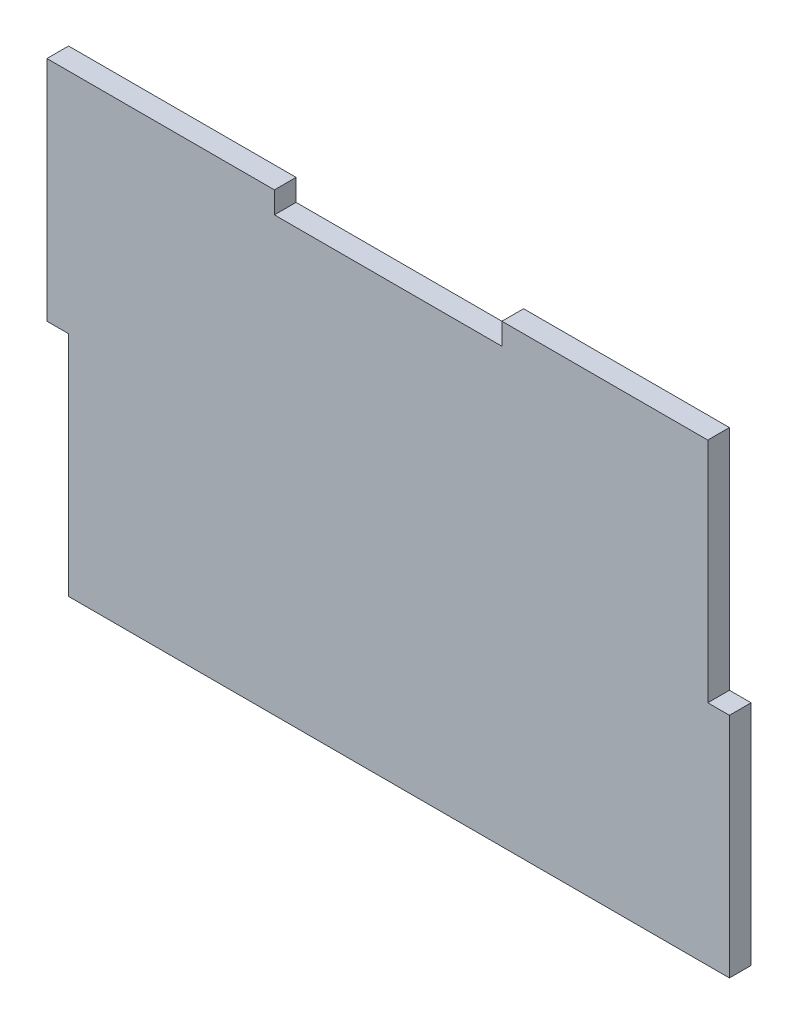
ISO-10303-21;
HEADER;
FILE_DESCRIPTION(('STEP AP214'),'2;1');
FILE_NAME('part.step','',(''),(''),'','','');
FILE_SCHEMA(('AUTOMOTIVE_DESIGN { 1 0 10303 214 1 1 1 1 }'));
ENDSEC;
DATA;
#1=APPLICATION_CONTEXT('core data for automotive mechanical design processes');
#2=APPLICATION_PROTOCOL_DEFINITION('international standard','automotive_design',2000,#1);
#3=PRODUCT_CONTEXT('',#1,'mechanical');
#4=PRODUCT('Part','Part','',(#3));
#5=PRODUCT_RELATED_PRODUCT_CATEGORY('part','',(#4));
#6=PRODUCT_DEFINITION_FORMATION('','',#4);
#7=PRODUCT_DEFINITION_CONTEXT('part definition',#1,'design');
#8=PRODUCT_DEFINITION('design','',#6,#7);
#9=PRODUCT_DEFINITION_SHAPE('','',#8);
#10=(LENGTH_UNIT() NAMED_UNIT(*) SI_UNIT(.MILLI.,.METRE.));
#11=(NAMED_UNIT(*) PLANE_ANGLE_UNIT() SI_UNIT($,.RADIAN.));
#12=(NAMED_UNIT(*) SI_UNIT($,.STERADIAN.) SOLID_ANGLE_UNIT());
#13=UNCERTAINTY_MEASURE_WITH_UNIT(LENGTH_MEASURE(1.E-05),#10,'distance_accuracy_value','');
#14=(GEOMETRIC_REPRESENTATION_CONTEXT(3) GLOBAL_UNCERTAINTY_ASSIGNED_CONTEXT((#13)) GLOBAL_UNIT_ASSIGNED_CONTEXT((#10,
#11,#12)) REPRESENTATION_CONTEXT('',''));
#15=CARTESIAN_POINT('',(0.,0.,0.));
#16=DIRECTION('',(0.,0.,1.));
#17=DIRECTION('',(1.,0.,0.));
#18=AXIS2_PLACEMENT_3D('',#15,#16,#17);
#19=CARTESIAN_POINT('',(-16.6666666666667,50.,3.175));
#20=DIRECTION('',(0.,-1.,0.));
#21=DIRECTION('',(1.,0.,0.));
#22=AXIS2_PLACEMENT_3D('',#19,#20,#21);
#23=PLANE('',#22);
#24=DIRECTION('',(-1.,0.,0.));
#25=VECTOR('',#24,1.);
#26=CARTESIAN_POINT('',(-16.6666666666667,50.,0.));
#27=LINE('',#26,#25);
#28=CARTESIAN_POINT('',(-16.6666666666667,50.,0.));
#29=VERTEX_POINT('',#28);
#30=CARTESIAN_POINT('',(-50.,50.,0.));
#31=VERTEX_POINT('',#30);
#32=EDGE_CURVE('E164',#29,#31,#27,.T.);
#33=ORIENTED_EDGE('',*,*,#32,.T.);
#34=DIRECTION('',(0.,0.,-1.));
#35=VECTOR('',#34,1.);
#36=CARTESIAN_POINT('',(-50.,50.,3.175));
#37=LINE('',#36,#35);
#38=CARTESIAN_POINT('',(-50.,50.,3.175));
#39=VERTEX_POINT('',#38);
#40=EDGE_CURVE('E11',#39,#31,#37,.T.);
#41=ORIENTED_EDGE('',*,*,#40,.F.);
#42=DIRECTION('',(-1.,0.,0.));
#43=VECTOR('',#42,1.);
#44=CARTESIAN_POINT('',(-16.6666666666667,50.,3.175));
#45=LINE('',#44,#43);
#46=CARTESIAN_POINT('',(-16.6666666666667,50.,3.175));
#47=VERTEX_POINT('',#46);
#48=EDGE_CURVE('E199',#47,#39,#45,.T.);
#49=ORIENTED_EDGE('',*,*,#48,.F.);
#50=DIRECTION('',(0.,0.,-1.));
#51=VECTOR('',#50,1.);
#52=CARTESIAN_POINT('',(-16.6666666666667,50.,3.175));
#53=LINE('',#52,#51);
#54=EDGE_CURVE('E160',#47,#29,#53,.T.);
#55=ORIENTED_EDGE('',*,*,#54,.T.);
#56=EDGE_LOOP('',(#33,#41,#49,#55));
#57=FACE_BOUND('',#56,.T.);
#58=ADVANCED_FACE('F39',(#57),#23,.F.);
#59=CARTESIAN_POINT('',(-50.,16.6666666666667,3.175));
#60=DIRECTION('',(1.,0.,0.));
#61=DIRECTION('',(0.,0.,-1.));
#62=AXIS2_PLACEMENT_3D('',#59,#60,#61);
#63=PLANE('',#62);
#64=DIRECTION('',(0.,-1.,0.));
#65=VECTOR('',#64,1.);
#66=CARTESIAN_POINT('',(-50.,16.6666666666667,0.));
#67=LINE('',#66,#65);
#68=CARTESIAN_POINT('',(-50.,16.6666666666667,0.));
#69=VERTEX_POINT('',#68);
#70=EDGE_CURVE('E168',#31,#69,#67,.T.);
#71=ORIENTED_EDGE('',*,*,#70,.T.);
#72=DIRECTION('',(0.,0.,-1.));
#73=VECTOR('',#72,1.);
#74=CARTESIAN_POINT('',(-50.,16.6666666666667,3.175));
#75=LINE('',#74,#73);
#76=CARTESIAN_POINT('',(-50.,16.6666666666667,3.175));
#77=VERTEX_POINT('',#76);
#78=EDGE_CURVE('E48',#77,#69,#75,.T.);
#79=ORIENTED_EDGE('',*,*,#78,.F.);
#80=DIRECTION('',(0.,-1.,0.));
#81=VECTOR('',#80,1.);
#82=CARTESIAN_POINT('',(-50.,16.6666666666667,3.175));
#83=LINE('',#82,#81);
#84=EDGE_CURVE('E111',#39,#77,#83,.T.);
#85=ORIENTED_EDGE('',*,*,#84,.F.);
#86=ORIENTED_EDGE('',*,*,#40,.T.);
#87=EDGE_LOOP('',(#71,#79,#85,#86));
#88=FACE_BOUND('',#87,.T.);
#89=ADVANCED_FACE('F292',(#88),#63,.F.);
#90=CARTESIAN_POINT('',(-50.,16.6666666666667,3.175));
#91=DIRECTION('',(0.,1.,0.));
#92=DIRECTION('',(0.,0.,1.));
#93=AXIS2_PLACEMENT_3D('',#90,#91,#92);
#94=PLANE('',#93);
#95=DIRECTION('',(1.,0.,0.));
#96=VECTOR('',#95,1.);
#97=CARTESIAN_POINT('',(-50.,16.6666666666667,0.));
#98=LINE('',#97,#96);
#99=CARTESIAN_POINT('',(-46.825,16.6666666666667,0.));
#100=VERTEX_POINT('',#99);
#101=EDGE_CURVE('E171',#69,#100,#98,.T.);
#102=ORIENTED_EDGE('',*,*,#101,.T.);
#103=DIRECTION('',(0.,0.,-1.));
#104=VECTOR('',#103,1.);
#105=CARTESIAN_POINT('',(-46.825,16.6666666666667,3.175));
#106=LINE('',#105,#104);
#107=CARTESIAN_POINT('',(-46.825,16.6666666666667,3.175));
#108=VERTEX_POINT('',#107);
#109=EDGE_CURVE('E226',#108,#100,#106,.T.);
#110=ORIENTED_EDGE('',*,*,#109,.F.);
#111=DIRECTION('',(1.,0.,0.));
#112=VECTOR('',#111,1.);
#113=CARTESIAN_POINT('',(-50.,16.6666666666667,3.175));
#114=LINE('',#113,#112);
#115=EDGE_CURVE('E236',#77,#108,#114,.T.);
#116=ORIENTED_EDGE('',*,*,#115,.F.);
#117=ORIENTED_EDGE('',*,*,#78,.T.);
#118=EDGE_LOOP('',(#102,#110,#116,#117));
#119=FACE_BOUND('',#118,.T.);
#120=ADVANCED_FACE('F234',(#119),#94,.F.);
#121=CARTESIAN_POINT('',(-46.825,16.6666666666667,3.175));
#122=DIRECTION('',(1.,0.,0.));
#123=DIRECTION('',(0.,0.,-1.));
#124=AXIS2_PLACEMENT_3D('',#121,#122,#123);
#125=PLANE('',#124);
#126=DIRECTION('',(0.,-1.,0.));
#127=VECTOR('',#126,1.);
#128=CARTESIAN_POINT('',(-46.825,16.6666666666667,0.));
#129=LINE('',#128,#127);
#130=CARTESIAN_POINT('',(-46.825,-16.6666666666667,0.));
#131=VERTEX_POINT('',#130);
#132=EDGE_CURVE('E174',#100,#131,#129,.T.);
#133=ORIENTED_EDGE('',*,*,#132,.T.);
#134=DIRECTION('',(0.,0.,-1.));
#135=VECTOR('',#134,1.);
#136=CARTESIAN_POINT('',(-46.825,-16.6666666666667,3.175));
#137=LINE('',#136,#135);
#138=CARTESIAN_POINT('',(-46.825,-16.6666666666667,3.175));
#139=VERTEX_POINT('',#138);
#140=EDGE_CURVE('E222',#139,#131,#137,.T.);
#141=ORIENTED_EDGE('',*,*,#140,.F.);
#142=DIRECTION('',(0.,-1.,0.));
#143=VECTOR('',#142,1.);
#144=CARTESIAN_POINT('',(-46.825,16.6666666666667,3.175));
#145=LINE('',#144,#143);
#146=EDGE_CURVE('E254',#108,#139,#145,.T.);
#147=ORIENTED_EDGE('',*,*,#146,.F.);
#148=ORIENTED_EDGE('',*,*,#109,.T.);
#149=EDGE_LOOP('',(#133,#141,#147,#148));
#150=FACE_BOUND('',#149,.T.);
#151=ADVANCED_FACE('F244',(#150),#125,.F.);
#152=CARTESIAN_POINT('',(50.,-16.6666666666667,3.175));
#153=DIRECTION('',(0.,1.,0.));
#154=DIRECTION('',(-1.,0.,0.));
#155=AXIS2_PLACEMENT_3D('',#152,#153,#154);
#156=PLANE('',#155);
#157=DIRECTION('',(1.,0.,0.));
#158=VECTOR('',#157,1.);
#159=CARTESIAN_POINT('',(50.,-16.6666666666667,0.));
#160=LINE('',#159,#158);
#161=CARTESIAN_POINT('',(50.,-16.6666666666667,0.));
#162=VERTEX_POINT('',#161);
#163=EDGE_CURVE('E178',#131,#162,#160,.T.);
#164=ORIENTED_EDGE('',*,*,#163,.T.);
#165=DIRECTION('',(0.,0.,-1.));
#166=VECTOR('',#165,1.);
#167=CARTESIAN_POINT('',(50.,-16.6666666666667,3.175));
#168=LINE('',#167,#166);
#169=CARTESIAN_POINT('',(50.,-16.6666666666667,3.175));
#170=VERTEX_POINT('',#169);
#171=EDGE_CURVE('E218',#170,#162,#168,.T.);
#172=ORIENTED_EDGE('',*,*,#171,.F.);
#173=DIRECTION('',(1.,0.,0.));
#174=VECTOR('',#173,1.);
#175=CARTESIAN_POINT('',(-46.825,-16.6666666666667,3.175));
#176=LINE('',#175,#174);
#177=EDGE_CURVE('E250',#139,#170,#176,.T.);
#178=ORIENTED_EDGE('',*,*,#177,.F.);
#179=ORIENTED_EDGE('',*,*,#140,.T.);
#180=EDGE_LOOP('',(#164,#172,#178,#179));
#181=FACE_BOUND('',#180,.T.);
#182=ADVANCED_FACE('F248',(#181),#156,.F.);
#183=CARTESIAN_POINT('',(50.,-16.6666666666667,3.175));
#184=DIRECTION('',(-1.,0.,0.));
#185=DIRECTION('',(0.,0.,1.));
#186=AXIS2_PLACEMENT_3D('',#183,#184,#185);
#187=PLANE('',#186);
#188=DIRECTION('',(0.,1.,0.));
#189=VECTOR('',#188,1.);
#190=CARTESIAN_POINT('',(50.,-16.6666666666667,0.));
#191=LINE('',#190,#189);
#192=CARTESIAN_POINT('',(50.,16.6666666666667,0.));
#193=VERTEX_POINT('',#192);
#194=EDGE_CURVE('E181',#162,#193,#191,.T.);
#195=ORIENTED_EDGE('',*,*,#194,.T.);
#196=DIRECTION('',(0.,0.,-1.));
#197=VECTOR('',#196,1.);
#198=CARTESIAN_POINT('',(50.,16.6666666666667,3.175));
#199=LINE('',#198,#197);
#200=CARTESIAN_POINT('',(50.,16.6666666666667,3.175));
#201=VERTEX_POINT('',#200);
#202=EDGE_CURVE('E214',#201,#193,#199,.T.);
#203=ORIENTED_EDGE('',*,*,#202,.F.);
#204=DIRECTION('',(0.,1.,0.));
#205=VECTOR('',#204,1.);
#206=CARTESIAN_POINT('',(50.,-16.6666666666667,3.175));
#207=LINE('',#206,#205);
#208=EDGE_CURVE('E253',#170,#201,#207,.T.);
#209=ORIENTED_EDGE('',*,*,#208,.F.);
#210=ORIENTED_EDGE('',*,*,#171,.T.);
#211=EDGE_LOOP('',(#195,#203,#209,#210));
#212=FACE_BOUND('',#211,.T.);
#213=ADVANCED_FACE('F305',(#212),#187,.F.);
#214=CARTESIAN_POINT('',(50.,16.6666666666667,3.175));
#215=DIRECTION('',(0.,-1.,0.));
#216=DIRECTION('',(0.,0.,-1.));
#217=AXIS2_PLACEMENT_3D('',#214,#215,#216);
#218=PLANE('',#217);
#219=DIRECTION('',(-1.,0.,0.));
#220=VECTOR('',#219,1.);
#221=CARTESIAN_POINT('',(50.,16.6666666666667,0.));
#222=LINE('',#221,#220);
#223=CARTESIAN_POINT('',(46.825,16.6666666666667,0.));
#224=VERTEX_POINT('',#223);
#225=EDGE_CURVE('E184',#193,#224,#222,.T.);
#226=ORIENTED_EDGE('',*,*,#225,.T.);
#227=DIRECTION('',(0.,0.,-1.));
#228=VECTOR('',#227,1.);
#229=CARTESIAN_POINT('',(46.825,16.6666666666667,3.175));
#230=LINE('',#229,#228);
#231=CARTESIAN_POINT('',(46.825,16.6666666666667,3.175));
#232=VERTEX_POINT('',#231);
#233=EDGE_CURVE('E210',#232,#224,#230,.T.);
#234=ORIENTED_EDGE('',*,*,#233,.F.);
#235=DIRECTION('',(-1.,0.,0.));
#236=VECTOR('',#235,1.);
#237=CARTESIAN_POINT('',(50.,16.6666666666667,3.175));
#238=LINE('',#237,#236);
#239=EDGE_CURVE('E258',#201,#232,#238,.T.);
#240=ORIENTED_EDGE('',*,*,#239,.F.);
#241=ORIENTED_EDGE('',*,*,#202,.T.);
#242=EDGE_LOOP('',(#226,#234,#240,#241));
#243=FACE_BOUND('',#242,.T.);
#244=ADVANCED_FACE('F308',(#243),#218,.F.);
#245=CARTESIAN_POINT('',(46.825,16.6666666666667,3.175));
#246=DIRECTION('',(-1.,0.,0.));
#247=DIRECTION('',(0.,0.,1.));
#248=AXIS2_PLACEMENT_3D('',#245,#246,#247);
#249=PLANE('',#248);
#250=DIRECTION('',(0.,1.,0.));
#251=VECTOR('',#250,1.);
#252=CARTESIAN_POINT('',(46.825,16.6666666666667,0.));
#253=LINE('',#252,#251);
#254=CARTESIAN_POINT('',(46.825,50.,0.));
#255=VERTEX_POINT('',#254);
#256=EDGE_CURVE('E187',#224,#255,#253,.T.);
#257=ORIENTED_EDGE('',*,*,#256,.T.);
#258=DIRECTION('',(0.,0.,-1.));
#259=VECTOR('',#258,1.);
#260=CARTESIAN_POINT('',(46.825,50.,3.175));
#261=LINE('',#260,#259);
#262=CARTESIAN_POINT('',(46.825,50.,3.175));
#263=VERTEX_POINT('',#262);
#264=EDGE_CURVE('E206',#263,#255,#261,.T.);
#265=ORIENTED_EDGE('',*,*,#264,.F.);
#266=DIRECTION('',(0.,1.,0.));
#267=VECTOR('',#266,1.);
#268=CARTESIAN_POINT('',(46.825,16.6666666666667,3.175));
#269=LINE('',#268,#267);
#270=EDGE_CURVE('E265',#232,#263,#269,.T.);
#271=ORIENTED_EDGE('',*,*,#270,.F.);
#272=ORIENTED_EDGE('',*,*,#233,.T.);
#273=EDGE_LOOP('',(#257,#265,#271,#272));
#274=FACE_BOUND('',#273,.T.);
#275=ADVANCED_FACE('F273',(#274),#249,.F.);
#276=CARTESIAN_POINT('',(46.825,50.,3.175));
#277=DIRECTION('',(0.,-1.,0.));
#278=DIRECTION('',(1.,0.,0.));
#279=AXIS2_PLACEMENT_3D('',#276,#277,#278);
#280=PLANE('',#279);
#281=DIRECTION('',(-1.,0.,0.));
#282=VECTOR('',#281,1.);
#283=CARTESIAN_POINT('',(46.825,50.,0.));
#284=LINE('',#283,#282);
#285=CARTESIAN_POINT('',(16.6666666666667,50.,0.));
#286=VERTEX_POINT('',#285);
#287=EDGE_CURVE('E190',#255,#286,#284,.T.);
#288=ORIENTED_EDGE('',*,*,#287,.T.);
#289=DIRECTION('',(0.,0.,-1.));
#290=VECTOR('',#289,1.);
#291=CARTESIAN_POINT('',(16.6666666666667,50.,3.175));
#292=LINE('',#291,#290);
#293=CARTESIAN_POINT('',(16.6666666666667,50.,3.175));
#294=VERTEX_POINT('',#293);
#295=EDGE_CURVE('E153',#294,#286,#292,.T.);
#296=ORIENTED_EDGE('',*,*,#295,.F.);
#297=DIRECTION('',(-1.,0.,0.));
#298=VECTOR('',#297,1.);
#299=CARTESIAN_POINT('',(46.825,50.,3.175));
#300=LINE('',#299,#298);
#301=EDGE_CURVE('E142',#263,#294,#300,.T.);
#302=ORIENTED_EDGE('',*,*,#301,.F.);
#303=ORIENTED_EDGE('',*,*,#264,.T.);
#304=EDGE_LOOP('',(#288,#296,#302,#303));
#305=FACE_BOUND('',#304,.T.);
#306=ADVANCED_FACE('F277',(#305),#280,.F.);
#307=CARTESIAN_POINT('',(16.6666666666667,50.,3.175));
#308=DIRECTION('',(1.,0.,0.));
#309=DIRECTION('',(0.,0.,-1.));
#310=AXIS2_PLACEMENT_3D('',#307,#308,#309);
#311=PLANE('',#310);
#312=DIRECTION('',(0.,-1.,0.));
#313=VECTOR('',#312,1.);
#314=CARTESIAN_POINT('',(16.6666666666667,50.,0.));
#315=LINE('',#314,#313);
#316=CARTESIAN_POINT('',(16.6666666666667,46.825,0.));
#317=VERTEX_POINT('',#316);
#318=EDGE_CURVE('E151',#286,#317,#315,.T.);
#319=ORIENTED_EDGE('',*,*,#318,.T.);
#320=DIRECTION('',(0.,0.,-1.));
#321=VECTOR('',#320,1.);
#322=CARTESIAN_POINT('',(16.6666666666667,46.825,3.175));
#323=LINE('',#322,#321);
#324=CARTESIAN_POINT('',(16.6666666666667,46.825,3.175));
#325=VERTEX_POINT('',#324);
#326=EDGE_CURVE('E148',#325,#317,#323,.T.);
#327=ORIENTED_EDGE('',*,*,#326,.F.);
#328=DIRECTION('',(0.,-1.,0.));
#329=VECTOR('',#328,1.);
#330=CARTESIAN_POINT('',(16.6666666666667,50.,3.175));
#331=LINE('',#330,#329);
#332=EDGE_CURVE('E136',#294,#325,#331,.T.);
#333=ORIENTED_EDGE('',*,*,#332,.F.);
#334=ORIENTED_EDGE('',*,*,#295,.T.);
#335=EDGE_LOOP('',(#319,#327,#333,#334));
#336=FACE_BOUND('',#335,.T.);
#337=ADVANCED_FACE('F149',(#336),#311,.F.);
#338=CARTESIAN_POINT('',(-16.6666666666667,46.825,3.175));
#339=DIRECTION('',(0.,-1.,0.));
#340=DIRECTION('',(0.,0.,-1.));
#341=AXIS2_PLACEMENT_3D('',#338,#339,#340);
#342=PLANE('',#341);
#343=DIRECTION('',(-1.,0.,0.));
#344=VECTOR('',#343,1.);
#345=CARTESIAN_POINT('',(-16.6666666666667,46.825,0.));
#346=LINE('',#345,#344);
#347=CARTESIAN_POINT('',(-16.6666666666667,46.825,0.));
#348=VERTEX_POINT('',#347);
#349=EDGE_CURVE('E97',#317,#348,#346,.T.);
#350=ORIENTED_EDGE('',*,*,#349,.T.);
#351=DIRECTION('',(0.,0.,-1.));
#352=VECTOR('',#351,1.);
#353=CARTESIAN_POINT('',(-16.6666666666667,46.825,3.175));
#354=LINE('',#353,#352);
#355=CARTESIAN_POINT('',(-16.6666666666667,46.825,3.175));
#356=VERTEX_POINT('',#355);
#357=EDGE_CURVE('E154',#356,#348,#354,.T.);
#358=ORIENTED_EDGE('',*,*,#357,.F.);
#359=DIRECTION('',(-1.,0.,0.));
#360=VECTOR('',#359,1.);
#361=CARTESIAN_POINT('',(-16.6666666666667,46.825,3.175));
#362=LINE('',#361,#360);
#363=EDGE_CURVE('E140',#325,#356,#362,.T.);
#364=ORIENTED_EDGE('',*,*,#363,.F.);
#365=ORIENTED_EDGE('',*,*,#326,.T.);
#366=EDGE_LOOP('',(#350,#358,#364,#365));
#367=FACE_BOUND('',#366,.T.);
#368=ADVANCED_FACE('F156',(#367),#342,.F.);
#369=CARTESIAN_POINT('',(-16.6666666666667,50.,3.175));
#370=DIRECTION('',(-1.,0.,0.));
#371=DIRECTION('',(0.,0.,1.));
#372=AXIS2_PLACEMENT_3D('',#369,#370,#371);
#373=PLANE('',#372);
#374=DIRECTION('',(0.,1.,0.));
#375=VECTOR('',#374,1.);
#376=CARTESIAN_POINT('',(-16.6666666666667,50.,0.));
#377=LINE('',#376,#375);
#378=EDGE_CURVE('E103',#348,#29,#377,.T.);
#379=ORIENTED_EDGE('',*,*,#378,.T.);
#380=ORIENTED_EDGE('',*,*,#54,.F.);
#381=DIRECTION('',(0.,1.,0.));
#382=VECTOR('',#381,1.);
#383=CARTESIAN_POINT('',(-16.6666666666667,50.,3.175));
#384=LINE('',#383,#382);
#385=EDGE_CURVE('E56',#356,#47,#384,.T.);
#386=ORIENTED_EDGE('',*,*,#385,.F.);
#387=ORIENTED_EDGE('',*,*,#357,.T.);
#388=EDGE_LOOP('',(#379,#380,#386,#387));
#389=FACE_BOUND('',#388,.T.);
#390=ADVANCED_FACE('F281',(#389),#373,.F.);
#391=CARTESIAN_POINT('',(0.,0.,3.175));
#392=DIRECTION('',(0.,0.,-1.));
#393=DIRECTION('',(-1.,0.,0.));
#394=AXIS2_PLACEMENT_3D('',#391,#392,#393);
#395=PLANE('',#394);
#396=ORIENTED_EDGE('',*,*,#48,.T.);
#397=ORIENTED_EDGE('',*,*,#84,.T.);
#398=ORIENTED_EDGE('',*,*,#115,.T.);
#399=ORIENTED_EDGE('',*,*,#146,.T.);
#400=ORIENTED_EDGE('',*,*,#177,.T.);
#401=ORIENTED_EDGE('',*,*,#208,.T.);
#402=ORIENTED_EDGE('',*,*,#239,.T.);
#403=ORIENTED_EDGE('',*,*,#270,.T.);
#404=ORIENTED_EDGE('',*,*,#301,.T.);
#405=ORIENTED_EDGE('',*,*,#332,.T.);
#406=ORIENTED_EDGE('',*,*,#363,.T.);
#407=ORIENTED_EDGE('',*,*,#385,.T.);
#408=EDGE_LOOP('',(#396,#397,#398,#399,#400,#401,#402,#403,#404,#405,#406,#407));
#409=FACE_BOUND('',#408,.T.);
#410=ADVANCED_FACE('F138',(#409),#395,.F.);
#411=CARTESIAN_POINT('',(0.,0.,0.));
#412=DIRECTION('',(0.,0.,-1.));
#413=DIRECTION('',(-1.,0.,0.));
#414=AXIS2_PLACEMENT_3D('',#411,#412,#413);
#415=PLANE('',#414);
#416=ORIENTED_EDGE('',*,*,#32,.F.);
#417=ORIENTED_EDGE('',*,*,#378,.F.);
#418=ORIENTED_EDGE('',*,*,#349,.F.);
#419=ORIENTED_EDGE('',*,*,#318,.F.);
#420=ORIENTED_EDGE('',*,*,#287,.F.);
#421=ORIENTED_EDGE('',*,*,#256,.F.);
#422=ORIENTED_EDGE('',*,*,#225,.F.);
#423=ORIENTED_EDGE('',*,*,#194,.F.);
#424=ORIENTED_EDGE('',*,*,#163,.F.);
#425=ORIENTED_EDGE('',*,*,#132,.F.);
#426=ORIENTED_EDGE('',*,*,#101,.F.);
#427=ORIENTED_EDGE('',*,*,#70,.F.);
#428=EDGE_LOOP('',(#416,#417,#418,#419,#420,#421,#422,#423,#424,#425,#426,#427));
#429=FACE_BOUND('',#428,.T.);
#430=ADVANCED_FACE('F240',(#429),#415,.T.);
#431=CLOSED_SHELL('',(#58,#89,#120,#151,#182,#213,#244,#275,#306,#337,#368,#390,#410,#430));
#432=MANIFOLD_SOLID_BREP('B2',#431);
#433=ADVANCED_BREP_SHAPE_REPRESENTATION('',(#18,#432),#14);
#434=SHAPE_DEFINITION_REPRESENTATION(#9,#433);
ENDSEC;
END-ISO-10303-21;
